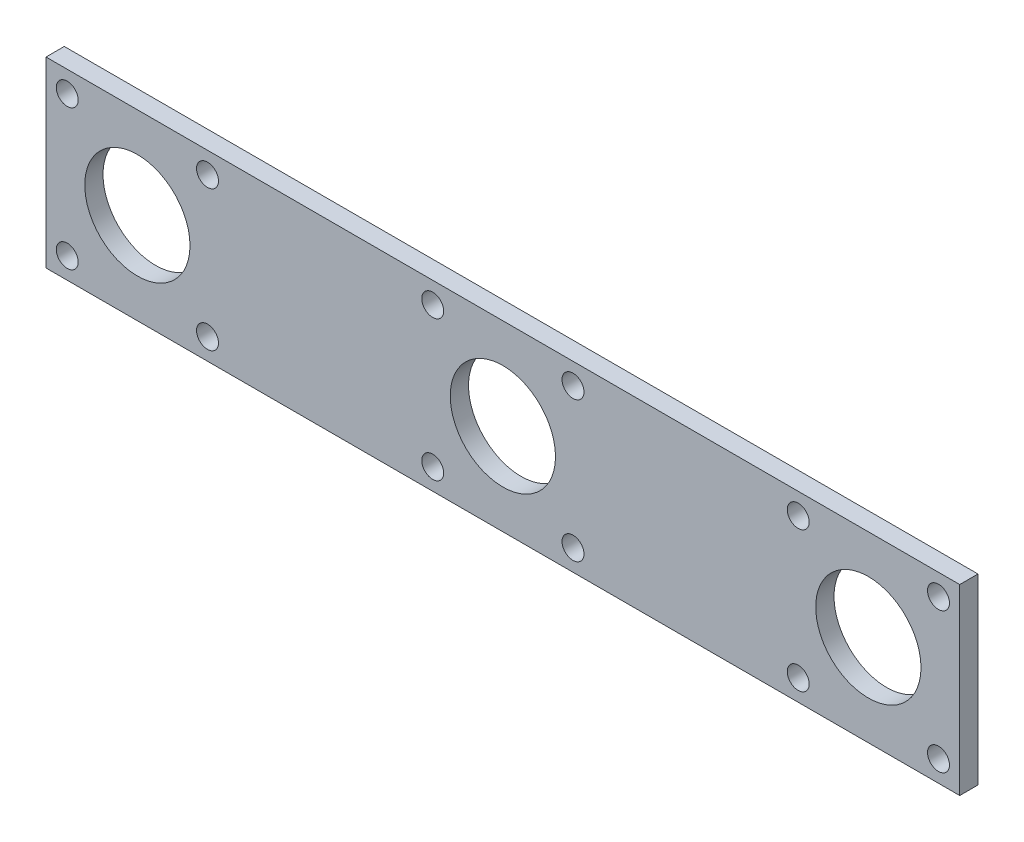
ISO-10303-21;
HEADER;
FILE_DESCRIPTION(('STEP AP214'),'2;1');
FILE_NAME('part.step','',(''),(''),'','','');
FILE_SCHEMA(('AUTOMOTIVE_DESIGN { 1 0 10303 214 1 1 1 1 }'));
ENDSEC;
DATA;
#1=APPLICATION_CONTEXT('core data for automotive mechanical design processes');
#2=APPLICATION_PROTOCOL_DEFINITION('international standard','automotive_design',2000,#1);
#3=PRODUCT_CONTEXT('',#1,'mechanical');
#4=PRODUCT('Part','Part','',(#3));
#5=PRODUCT_RELATED_PRODUCT_CATEGORY('part','',(#4));
#6=PRODUCT_DEFINITION_FORMATION('','',#4);
#7=PRODUCT_DEFINITION_CONTEXT('part definition',#1,'design');
#8=PRODUCT_DEFINITION('design','',#6,#7);
#9=PRODUCT_DEFINITION_SHAPE('','',#8);
#10=(LENGTH_UNIT() NAMED_UNIT(*) SI_UNIT(.MILLI.,.METRE.));
#11=(NAMED_UNIT(*) PLANE_ANGLE_UNIT() SI_UNIT($,.RADIAN.));
#12=(NAMED_UNIT(*) SI_UNIT($,.STERADIAN.) SOLID_ANGLE_UNIT());
#13=UNCERTAINTY_MEASURE_WITH_UNIT(LENGTH_MEASURE(1.E-05),#10,'distance_accuracy_value','');
#14=(GEOMETRIC_REPRESENTATION_CONTEXT(3) GLOBAL_UNCERTAINTY_ASSIGNED_CONTEXT((#13)) GLOBAL_UNIT_ASSIGNED_CONTEXT((#10,
#11,#12)) REPRESENTATION_CONTEXT('',''));
#15=CARTESIAN_POINT('',(0.,0.,0.));
#16=DIRECTION('',(0.,0.,1.));
#17=DIRECTION('',(1.,0.,0.));
#18=AXIS2_PLACEMENT_3D('',#15,#16,#17);
#19=CARTESIAN_POINT('',(0.,0.,2.54));
#20=DIRECTION('',(0.,0.,-1.));
#21=DIRECTION('',(-1.,0.,0.));
#22=AXIS2_PLACEMENT_3D('',#19,#20,#21);
#23=PLANE('',#22);
#24=DIRECTION('',(0.,1.,0.));
#25=VECTOR('',#24,1.);
#26=CARTESIAN_POINT('',(63.5,-12.7,2.54));
#27=LINE('',#26,#25);
#28=CARTESIAN_POINT('',(63.5,-12.7,2.54));
#29=VERTEX_POINT('',#28);
#30=CARTESIAN_POINT('',(63.5,12.7,2.54));
#31=VERTEX_POINT('',#30);
#32=EDGE_CURVE('E92',#29,#31,#27,.T.);
#33=ORIENTED_EDGE('',*,*,#32,.T.);
#34=DIRECTION('',(-1.,0.,0.));
#35=VECTOR('',#34,1.);
#36=CARTESIAN_POINT('',(-63.5,12.7,2.54));
#37=LINE('',#36,#35);
#38=CARTESIAN_POINT('',(-63.5,12.7,2.54));
#39=VERTEX_POINT('',#38);
#40=EDGE_CURVE('E87',#31,#39,#37,.T.);
#41=ORIENTED_EDGE('',*,*,#40,.T.);
#42=DIRECTION('',(0.,-1.,0.));
#43=VECTOR('',#42,1.);
#44=CARTESIAN_POINT('',(-63.5,-12.7,2.54));
#45=LINE('',#44,#43);
#46=CARTESIAN_POINT('',(-63.5,-12.7,2.54));
#47=VERTEX_POINT('',#46);
#48=EDGE_CURVE('E90',#39,#47,#45,.T.);
#49=ORIENTED_EDGE('',*,*,#48,.T.);
#50=DIRECTION('',(1.,0.,0.));
#51=VECTOR('',#50,1.);
#52=CARTESIAN_POINT('',(-63.5,-12.7,2.54));
#53=LINE('',#52,#51);
#54=EDGE_CURVE('E57',#47,#29,#53,.T.);
#55=ORIENTED_EDGE('',*,*,#54,.T.);
#56=EDGE_LOOP('',(#33,#41,#49,#55));
#57=FACE_BOUND('',#56,.T.);
#58=CARTESIAN_POINT('',(0.,0.,2.54));
#59=DIRECTION('',(0.,0.,1.));
#60=DIRECTION('',(1.,0.,0.));
#61=AXIS2_PLACEMENT_3D('',#58,#59,#60);
#62=CIRCLE('',#61,7.3152);
#63=CARTESIAN_POINT('',(7.3152,0.,2.54));
#64=VERTEX_POINT('',#63);
#65=EDGE_CURVE('E112',#64,#64,#62,.T.);
#66=ORIENTED_EDGE('',*,*,#65,.F.);
#67=EDGE_LOOP('',(#66));
#68=FACE_BOUND('',#67,.T.);
#69=CARTESIAN_POINT('',(9.74840085287846,9.74840085287846,2.54));
#70=DIRECTION('',(0.,0.,1.));
#71=DIRECTION('',(1.,0.,0.));
#72=AXIS2_PLACEMENT_3D('',#69,#70,#71);
#73=CIRCLE('',#72,1.524);
#74=CARTESIAN_POINT('',(11.2724008528785,9.74840085287846,2.54));
#75=VERTEX_POINT('',#74);
#76=EDGE_CURVE('E134',#75,#75,#73,.T.);
#77=ORIENTED_EDGE('',*,*,#76,.F.);
#78=EDGE_LOOP('',(#77));
#79=FACE_BOUND('',#78,.T.);
#80=CARTESIAN_POINT('',(-9.74840085287846,-9.74840085287847,2.54));
#81=DIRECTION('',(0.,0.,1.));
#82=DIRECTION('',(1.,0.,0.));
#83=AXIS2_PLACEMENT_3D('',#80,#81,#82);
#84=CIRCLE('',#83,1.524);
#85=CARTESIAN_POINT('',(-8.22440085287846,-9.74840085287847,2.54));
#86=VERTEX_POINT('',#85);
#87=EDGE_CURVE('E142',#86,#86,#84,.T.);
#88=ORIENTED_EDGE('',*,*,#87,.F.);
#89=EDGE_LOOP('',(#88));
#90=FACE_BOUND('',#89,.T.);
#91=CARTESIAN_POINT('',(9.74840085287846,-9.74840085287847,2.54));
#92=DIRECTION('',(0.,0.,1.));
#93=DIRECTION('',(1.,0.,0.));
#94=AXIS2_PLACEMENT_3D('',#91,#92,#93);
#95=CIRCLE('',#94,1.524);
#96=CARTESIAN_POINT('',(11.2724008528785,-9.74840085287847,2.54));
#97=VERTEX_POINT('',#96);
#98=EDGE_CURVE('E150',#97,#97,#95,.T.);
#99=ORIENTED_EDGE('',*,*,#98,.F.);
#100=EDGE_LOOP('',(#99));
#101=FACE_BOUND('',#100,.T.);
#102=CARTESIAN_POINT('',(-9.74840085287846,9.74840085287846,2.54));
#103=DIRECTION('',(0.,0.,1.));
#104=DIRECTION('',(1.,0.,0.));
#105=AXIS2_PLACEMENT_3D('',#102,#103,#104);
#106=CIRCLE('',#105,1.524);
#107=CARTESIAN_POINT('',(-8.22440085287846,9.74840085287846,2.54));
#108=VERTEX_POINT('',#107);
#109=EDGE_CURVE('E158',#108,#108,#106,.T.);
#110=ORIENTED_EDGE('',*,*,#109,.F.);
#111=EDGE_LOOP('',(#110));
#112=FACE_BOUND('',#111,.T.);
#113=CARTESIAN_POINT('',(50.8,0.,2.54));
#114=DIRECTION('',(0.,0.,1.));
#115=DIRECTION('',(1.,0.,0.));
#116=AXIS2_PLACEMENT_3D('',#113,#114,#115);
#117=CIRCLE('',#116,7.3152);
#118=CARTESIAN_POINT('',(58.1152,0.,2.54));
#119=VERTEX_POINT('',#118);
#120=EDGE_CURVE('E166',#119,#119,#117,.T.);
#121=ORIENTED_EDGE('',*,*,#120,.F.);
#122=EDGE_LOOP('',(#121));
#123=FACE_BOUND('',#122,.T.);
#124=CARTESIAN_POINT('',(60.5484008528785,9.74840085287846,2.54));
#125=DIRECTION('',(0.,0.,1.));
#126=DIRECTION('',(1.,0.,0.));
#127=AXIS2_PLACEMENT_3D('',#124,#125,#126);
#128=CIRCLE('',#127,1.524);
#129=CARTESIAN_POINT('',(62.0724008528785,9.74840085287846,2.54));
#130=VERTEX_POINT('',#129);
#131=EDGE_CURVE('E174',#130,#130,#128,.T.);
#132=ORIENTED_EDGE('',*,*,#131,.F.);
#133=EDGE_LOOP('',(#132));
#134=FACE_BOUND('',#133,.T.);
#135=CARTESIAN_POINT('',(41.0515991471215,-9.74840085287847,2.54));
#136=DIRECTION('',(0.,0.,1.));
#137=DIRECTION('',(1.,0.,0.));
#138=AXIS2_PLACEMENT_3D('',#135,#136,#137);
#139=CIRCLE('',#138,1.52400000000001);
#140=CARTESIAN_POINT('',(42.5755991471215,-9.74840085287847,2.54));
#141=VERTEX_POINT('',#140);
#142=EDGE_CURVE('E182',#141,#141,#139,.T.);
#143=ORIENTED_EDGE('',*,*,#142,.F.);
#144=EDGE_LOOP('',(#143));
#145=FACE_BOUND('',#144,.T.);
#146=CARTESIAN_POINT('',(60.5484008528785,-9.74840085287847,2.54));
#147=DIRECTION('',(0.,0.,1.));
#148=DIRECTION('',(1.,0.,0.));
#149=AXIS2_PLACEMENT_3D('',#146,#147,#148);
#150=CIRCLE('',#149,1.524);
#151=CARTESIAN_POINT('',(62.0724008528785,-9.74840085287847,2.54));
#152=VERTEX_POINT('',#151);
#153=EDGE_CURVE('E190',#152,#152,#150,.T.);
#154=ORIENTED_EDGE('',*,*,#153,.F.);
#155=EDGE_LOOP('',(#154));
#156=FACE_BOUND('',#155,.T.);
#157=CARTESIAN_POINT('',(41.0515991471215,9.74840085287846,2.54));
#158=DIRECTION('',(0.,0.,1.));
#159=DIRECTION('',(1.,0.,0.));
#160=AXIS2_PLACEMENT_3D('',#157,#158,#159);
#161=CIRCLE('',#160,1.52400000000001);
#162=CARTESIAN_POINT('',(42.5755991471215,9.74840085287846,2.54));
#163=VERTEX_POINT('',#162);
#164=EDGE_CURVE('E198',#163,#163,#161,.T.);
#165=ORIENTED_EDGE('',*,*,#164,.F.);
#166=EDGE_LOOP('',(#165));
#167=FACE_BOUND('',#166,.T.);
#168=CARTESIAN_POINT('',(-50.8,0.,2.54));
#169=DIRECTION('',(0.,0.,1.));
#170=DIRECTION('',(1.,0.,0.));
#171=AXIS2_PLACEMENT_3D('',#168,#169,#170);
#172=CIRCLE('',#171,7.3152);
#173=CARTESIAN_POINT('',(-43.4848,0.,2.54));
#174=VERTEX_POINT('',#173);
#175=EDGE_CURVE('E206',#174,#174,#172,.T.);
#176=ORIENTED_EDGE('',*,*,#175,.F.);
#177=EDGE_LOOP('',(#176));
#178=FACE_BOUND('',#177,.T.);
#179=CARTESIAN_POINT('',(-41.0515991471215,9.74840085287846,2.54));
#180=DIRECTION('',(0.,0.,1.));
#181=DIRECTION('',(1.,0.,0.));
#182=AXIS2_PLACEMENT_3D('',#179,#180,#181);
#183=CIRCLE('',#182,1.524);
#184=CARTESIAN_POINT('',(-39.5275991471215,9.74840085287846,2.54));
#185=VERTEX_POINT('',#184);
#186=EDGE_CURVE('E214',#185,#185,#183,.T.);
#187=ORIENTED_EDGE('',*,*,#186,.F.);
#188=EDGE_LOOP('',(#187));
#189=FACE_BOUND('',#188,.T.);
#190=CARTESIAN_POINT('',(-60.5484008528785,-9.74840085287847,2.54));
#191=DIRECTION('',(0.,0.,1.));
#192=DIRECTION('',(1.,0.,0.));
#193=AXIS2_PLACEMENT_3D('',#190,#191,#192);
#194=CIRCLE('',#193,1.52400000000001);
#195=CARTESIAN_POINT('',(-59.0244008528785,-9.74840085287847,2.54));
#196=VERTEX_POINT('',#195);
#197=EDGE_CURVE('E222',#196,#196,#194,.T.);
#198=ORIENTED_EDGE('',*,*,#197,.F.);
#199=EDGE_LOOP('',(#198));
#200=FACE_BOUND('',#199,.T.);
#201=CARTESIAN_POINT('',(-41.0515991471215,-9.74840085287847,2.54));
#202=DIRECTION('',(0.,0.,1.));
#203=DIRECTION('',(1.,0.,0.));
#204=AXIS2_PLACEMENT_3D('',#201,#202,#203);
#205=CIRCLE('',#204,1.524);
#206=CARTESIAN_POINT('',(-39.5275991471215,-9.74840085287847,2.54));
#207=VERTEX_POINT('',#206);
#208=EDGE_CURVE('E230',#207,#207,#205,.T.);
#209=ORIENTED_EDGE('',*,*,#208,.F.);
#210=EDGE_LOOP('',(#209));
#211=FACE_BOUND('',#210,.T.);
#212=CARTESIAN_POINT('',(-60.5484008528785,9.74840085287846,2.54));
#213=DIRECTION('',(0.,0.,1.));
#214=DIRECTION('',(1.,0.,0.));
#215=AXIS2_PLACEMENT_3D('',#212,#213,#214);
#216=CIRCLE('',#215,1.524);
#217=CARTESIAN_POINT('',(-59.0244008528785,9.74840085287846,2.54));
#218=VERTEX_POINT('',#217);
#219=EDGE_CURVE('E238',#218,#218,#216,.T.);
#220=ORIENTED_EDGE('',*,*,#219,.F.);
#221=EDGE_LOOP('',(#220));
#222=FACE_BOUND('',#221,.T.);
#223=ADVANCED_FACE('F39',(#57,#68,#79,#90,#101,#112,#123,#134,#145,#156,#167,#178,#189,#200,
#211,#222),#23,.F.);
#224=CARTESIAN_POINT('',(0.,0.,0.));
#225=DIRECTION('',(0.,0.,-1.));
#226=DIRECTION('',(-1.,0.,0.));
#227=AXIS2_PLACEMENT_3D('',#224,#225,#226);
#228=PLANE('',#227);
#229=CARTESIAN_POINT('',(-41.0515991471215,-9.74840085287847,0.));
#230=DIRECTION('',(0.,0.,1.));
#231=DIRECTION('',(1.,0.,0.));
#232=AXIS2_PLACEMENT_3D('',#229,#230,#231);
#233=CIRCLE('',#232,1.524);
#234=CARTESIAN_POINT('',(-39.5275991471215,-9.74840085287847,0.));
#235=VERTEX_POINT('',#234);
#236=EDGE_CURVE('E234',#235,#235,#233,.T.);
#237=ORIENTED_EDGE('',*,*,#236,.T.);
#238=EDGE_LOOP('',(#237));
#239=FACE_BOUND('',#238,.T.);
#240=CARTESIAN_POINT('',(-41.0515991471215,9.74840085287846,0.));
#241=DIRECTION('',(0.,0.,1.));
#242=DIRECTION('',(1.,0.,0.));
#243=AXIS2_PLACEMENT_3D('',#240,#241,#242);
#244=CIRCLE('',#243,1.524);
#245=CARTESIAN_POINT('',(-39.5275991471215,9.74840085287846,0.));
#246=VERTEX_POINT('',#245);
#247=EDGE_CURVE('E218',#246,#246,#244,.T.);
#248=ORIENTED_EDGE('',*,*,#247,.T.);
#249=EDGE_LOOP('',(#248));
#250=FACE_BOUND('',#249,.T.);
#251=CARTESIAN_POINT('',(41.0515991471215,9.74840085287846,0.));
#252=DIRECTION('',(0.,0.,1.));
#253=DIRECTION('',(1.,0.,0.));
#254=AXIS2_PLACEMENT_3D('',#251,#252,#253);
#255=CIRCLE('',#254,1.52400000000001);
#256=CARTESIAN_POINT('',(42.5755991471215,9.74840085287846,0.));
#257=VERTEX_POINT('',#256);
#258=EDGE_CURVE('E202',#257,#257,#255,.T.);
#259=ORIENTED_EDGE('',*,*,#258,.T.);
#260=EDGE_LOOP('',(#259));
#261=FACE_BOUND('',#260,.T.);
#262=CARTESIAN_POINT('',(41.0515991471215,-9.74840085287847,0.));
#263=DIRECTION('',(0.,0.,1.));
#264=DIRECTION('',(1.,0.,0.));
#265=AXIS2_PLACEMENT_3D('',#262,#263,#264);
#266=CIRCLE('',#265,1.52400000000001);
#267=CARTESIAN_POINT('',(42.5755991471215,-9.74840085287847,0.));
#268=VERTEX_POINT('',#267);
#269=EDGE_CURVE('E186',#268,#268,#266,.T.);
#270=ORIENTED_EDGE('',*,*,#269,.T.);
#271=EDGE_LOOP('',(#270));
#272=FACE_BOUND('',#271,.T.);
#273=CARTESIAN_POINT('',(50.8,0.,0.));
#274=DIRECTION('',(0.,0.,1.));
#275=DIRECTION('',(1.,0.,0.));
#276=AXIS2_PLACEMENT_3D('',#273,#274,#275);
#277=CIRCLE('',#276,7.3152);
#278=CARTESIAN_POINT('',(58.1152,0.,0.));
#279=VERTEX_POINT('',#278);
#280=EDGE_CURVE('E170',#279,#279,#277,.T.);
#281=ORIENTED_EDGE('',*,*,#280,.T.);
#282=EDGE_LOOP('',(#281));
#283=FACE_BOUND('',#282,.T.);
#284=CARTESIAN_POINT('',(9.74840085287846,-9.74840085287847,0.));
#285=DIRECTION('',(0.,0.,1.));
#286=DIRECTION('',(1.,0.,0.));
#287=AXIS2_PLACEMENT_3D('',#284,#285,#286);
#288=CIRCLE('',#287,1.524);
#289=CARTESIAN_POINT('',(11.2724008528785,-9.74840085287847,0.));
#290=VERTEX_POINT('',#289);
#291=EDGE_CURVE('E154',#290,#290,#288,.T.);
#292=ORIENTED_EDGE('',*,*,#291,.T.);
#293=EDGE_LOOP('',(#292));
#294=FACE_BOUND('',#293,.T.);
#295=CARTESIAN_POINT('',(9.74840085287846,9.74840085287846,0.));
#296=DIRECTION('',(0.,0.,1.));
#297=DIRECTION('',(1.,0.,0.));
#298=AXIS2_PLACEMENT_3D('',#295,#296,#297);
#299=CIRCLE('',#298,1.524);
#300=CARTESIAN_POINT('',(11.2724008528785,9.74840085287846,0.));
#301=VERTEX_POINT('',#300);
#302=EDGE_CURVE('E138',#301,#301,#299,.T.);
#303=ORIENTED_EDGE('',*,*,#302,.T.);
#304=EDGE_LOOP('',(#303));
#305=FACE_BOUND('',#304,.T.);
#306=DIRECTION('',(0.,1.,0.));
#307=VECTOR('',#306,1.);
#308=CARTESIAN_POINT('',(63.5,-12.7,0.));
#309=LINE('',#308,#307);
#310=CARTESIAN_POINT('',(63.5,-12.7,0.));
#311=VERTEX_POINT('',#310);
#312=CARTESIAN_POINT('',(63.5,12.7,0.));
#313=VERTEX_POINT('',#312);
#314=EDGE_CURVE('E108',#311,#313,#309,.T.);
#315=ORIENTED_EDGE('',*,*,#314,.F.);
#316=DIRECTION('',(1.,0.,0.));
#317=VECTOR('',#316,1.);
#318=CARTESIAN_POINT('',(-63.5,-12.7,0.));
#319=LINE('',#318,#317);
#320=CARTESIAN_POINT('',(-63.5,-12.7,0.));
#321=VERTEX_POINT('',#320);
#322=EDGE_CURVE('E80',#321,#311,#319,.T.);
#323=ORIENTED_EDGE('',*,*,#322,.F.);
#324=DIRECTION('',(0.,-1.,0.));
#325=VECTOR('',#324,1.);
#326=CARTESIAN_POINT('',(-63.5,-12.7,0.));
#327=LINE('',#326,#325);
#328=CARTESIAN_POINT('',(-63.5,12.7,0.));
#329=VERTEX_POINT('',#328);
#330=EDGE_CURVE('E74',#329,#321,#327,.T.);
#331=ORIENTED_EDGE('',*,*,#330,.F.);
#332=DIRECTION('',(-1.,0.,0.));
#333=VECTOR('',#332,1.);
#334=CARTESIAN_POINT('',(-63.5,12.7,0.));
#335=LINE('',#334,#333);
#336=EDGE_CURVE('E97',#313,#329,#335,.T.);
#337=ORIENTED_EDGE('',*,*,#336,.F.);
#338=EDGE_LOOP('',(#315,#323,#331,#337));
#339=FACE_BOUND('',#338,.T.);
#340=CARTESIAN_POINT('',(0.,0.,0.));
#341=DIRECTION('',(0.,0.,1.));
#342=DIRECTION('',(1.,0.,0.));
#343=AXIS2_PLACEMENT_3D('',#340,#341,#342);
#344=CIRCLE('',#343,7.3152);
#345=CARTESIAN_POINT('',(7.3152,0.,0.));
#346=VERTEX_POINT('',#345);
#347=EDGE_CURVE('E130',#346,#346,#344,.T.);
#348=ORIENTED_EDGE('',*,*,#347,.T.);
#349=EDGE_LOOP('',(#348));
#350=FACE_BOUND('',#349,.T.);
#351=CARTESIAN_POINT('',(-9.74840085287846,-9.74840085287847,0.));
#352=DIRECTION('',(0.,0.,1.));
#353=DIRECTION('',(1.,0.,0.));
#354=AXIS2_PLACEMENT_3D('',#351,#352,#353);
#355=CIRCLE('',#354,1.524);
#356=CARTESIAN_POINT('',(-8.22440085287846,-9.74840085287847,0.));
#357=VERTEX_POINT('',#356);
#358=EDGE_CURVE('E146',#357,#357,#355,.T.);
#359=ORIENTED_EDGE('',*,*,#358,.T.);
#360=EDGE_LOOP('',(#359));
#361=FACE_BOUND('',#360,.T.);
#362=CARTESIAN_POINT('',(-9.74840085287846,9.74840085287846,0.));
#363=DIRECTION('',(0.,0.,1.));
#364=DIRECTION('',(1.,0.,0.));
#365=AXIS2_PLACEMENT_3D('',#362,#363,#364);
#366=CIRCLE('',#365,1.524);
#367=CARTESIAN_POINT('',(-8.22440085287846,9.74840085287846,0.));
#368=VERTEX_POINT('',#367);
#369=EDGE_CURVE('E162',#368,#368,#366,.T.);
#370=ORIENTED_EDGE('',*,*,#369,.T.);
#371=EDGE_LOOP('',(#370));
#372=FACE_BOUND('',#371,.T.);
#373=CARTESIAN_POINT('',(60.5484008528785,9.74840085287846,0.));
#374=DIRECTION('',(0.,0.,1.));
#375=DIRECTION('',(1.,0.,0.));
#376=AXIS2_PLACEMENT_3D('',#373,#374,#375);
#377=CIRCLE('',#376,1.524);
#378=CARTESIAN_POINT('',(62.0724008528785,9.74840085287846,0.));
#379=VERTEX_POINT('',#378);
#380=EDGE_CURVE('E178',#379,#379,#377,.T.);
#381=ORIENTED_EDGE('',*,*,#380,.T.);
#382=EDGE_LOOP('',(#381));
#383=FACE_BOUND('',#382,.T.);
#384=CARTESIAN_POINT('',(60.5484008528785,-9.74840085287847,0.));
#385=DIRECTION('',(0.,0.,1.));
#386=DIRECTION('',(1.,0.,0.));
#387=AXIS2_PLACEMENT_3D('',#384,#385,#386);
#388=CIRCLE('',#387,1.524);
#389=CARTESIAN_POINT('',(62.0724008528785,-9.74840085287847,0.));
#390=VERTEX_POINT('',#389);
#391=EDGE_CURVE('E194',#390,#390,#388,.T.);
#392=ORIENTED_EDGE('',*,*,#391,.T.);
#393=EDGE_LOOP('',(#392));
#394=FACE_BOUND('',#393,.T.);
#395=CARTESIAN_POINT('',(-50.8,0.,0.));
#396=DIRECTION('',(0.,0.,1.));
#397=DIRECTION('',(1.,0.,0.));
#398=AXIS2_PLACEMENT_3D('',#395,#396,#397);
#399=CIRCLE('',#398,7.3152);
#400=CARTESIAN_POINT('',(-43.4848,0.,0.));
#401=VERTEX_POINT('',#400);
#402=EDGE_CURVE('E210',#401,#401,#399,.T.);
#403=ORIENTED_EDGE('',*,*,#402,.T.);
#404=EDGE_LOOP('',(#403));
#405=FACE_BOUND('',#404,.T.);
#406=CARTESIAN_POINT('',(-60.5484008528785,-9.74840085287847,0.));
#407=DIRECTION('',(0.,0.,1.));
#408=DIRECTION('',(1.,0.,0.));
#409=AXIS2_PLACEMENT_3D('',#406,#407,#408);
#410=CIRCLE('',#409,1.52400000000001);
#411=CARTESIAN_POINT('',(-59.0244008528785,-9.74840085287847,0.));
#412=VERTEX_POINT('',#411);
#413=EDGE_CURVE('E226',#412,#412,#410,.T.);
#414=ORIENTED_EDGE('',*,*,#413,.T.);
#415=EDGE_LOOP('',(#414));
#416=FACE_BOUND('',#415,.T.);
#417=CARTESIAN_POINT('',(-60.5484008528785,9.74840085287846,0.));
#418=DIRECTION('',(0.,0.,1.));
#419=DIRECTION('',(1.,0.,0.));
#420=AXIS2_PLACEMENT_3D('',#417,#418,#419);
#421=CIRCLE('',#420,1.524);
#422=CARTESIAN_POINT('',(-59.0244008528785,9.74840085287846,0.));
#423=VERTEX_POINT('',#422);
#424=EDGE_CURVE('E242',#423,#423,#421,.T.);
#425=ORIENTED_EDGE('',*,*,#424,.T.);
#426=EDGE_LOOP('',(#425));
#427=FACE_BOUND('',#426,.T.);
#428=ADVANCED_FACE('F125',(#239,#250,#261,#272,#283,#294,#305,#339,#350,#361,#372,#383,#394,
#405,#416,#427),#228,.T.);
#429=CARTESIAN_POINT('',(63.5,-12.7,2.54));
#430=DIRECTION('',(-1.,0.,0.));
#431=DIRECTION('',(0.,0.,1.));
#432=AXIS2_PLACEMENT_3D('',#429,#430,#431);
#433=PLANE('',#432);
#434=ORIENTED_EDGE('',*,*,#314,.T.);
#435=DIRECTION('',(0.,0.,-1.));
#436=VECTOR('',#435,1.);
#437=CARTESIAN_POINT('',(63.5,12.7,2.54));
#438=LINE('',#437,#436);
#439=EDGE_CURVE('E11',#31,#313,#438,.T.);
#440=ORIENTED_EDGE('',*,*,#439,.F.);
#441=ORIENTED_EDGE('',*,*,#32,.F.);
#442=DIRECTION('',(0.,0.,-1.));
#443=VECTOR('',#442,1.);
#444=CARTESIAN_POINT('',(63.5,-12.7,2.54));
#445=LINE('',#444,#443);
#446=EDGE_CURVE('E104',#29,#311,#445,.T.);
#447=ORIENTED_EDGE('',*,*,#446,.T.);
#448=EDGE_LOOP('',(#434,#440,#441,#447));
#449=FACE_BOUND('',#448,.T.);
#450=ADVANCED_FACE('F41',(#449),#433,.F.);
#451=CARTESIAN_POINT('',(-63.5,12.7,2.54));
#452=DIRECTION('',(0.,-1.,0.));
#453=DIRECTION('',(0.,0.,-1.));
#454=AXIS2_PLACEMENT_3D('',#451,#452,#453);
#455=PLANE('',#454);
#456=ORIENTED_EDGE('',*,*,#336,.T.);
#457=DIRECTION('',(0.,0.,-1.));
#458=VECTOR('',#457,1.);
#459=CARTESIAN_POINT('',(-63.5,12.7,2.54));
#460=LINE('',#459,#458);
#461=EDGE_CURVE('E49',#39,#329,#460,.T.);
#462=ORIENTED_EDGE('',*,*,#461,.F.);
#463=ORIENTED_EDGE('',*,*,#40,.F.);
#464=ORIENTED_EDGE('',*,*,#439,.T.);
#465=EDGE_LOOP('',(#456,#462,#463,#464));
#466=FACE_BOUND('',#465,.T.);
#467=ADVANCED_FACE('F96',(#466),#455,.F.);
#468=CARTESIAN_POINT('',(-63.5,-12.7,2.54));
#469=DIRECTION('',(1.,0.,0.));
#470=DIRECTION('',(0.,0.,-1.));
#471=AXIS2_PLACEMENT_3D('',#468,#469,#470);
#472=PLANE('',#471);
#473=ORIENTED_EDGE('',*,*,#330,.T.);
#474=DIRECTION('',(0.,0.,-1.));
#475=VECTOR('',#474,1.);
#476=CARTESIAN_POINT('',(-63.5,-12.7,2.54));
#477=LINE('',#476,#475);
#478=EDGE_CURVE('E99',#47,#321,#477,.T.);
#479=ORIENTED_EDGE('',*,*,#478,.F.);
#480=ORIENTED_EDGE('',*,*,#48,.F.);
#481=ORIENTED_EDGE('',*,*,#461,.T.);
#482=EDGE_LOOP('',(#473,#479,#480,#481));
#483=FACE_BOUND('',#482,.T.);
#484=ADVANCED_FACE('F100',(#483),#472,.F.);
#485=CARTESIAN_POINT('',(-63.5,-12.7,2.54));
#486=DIRECTION('',(0.,1.,0.));
#487=DIRECTION('',(0.,0.,1.));
#488=AXIS2_PLACEMENT_3D('',#485,#486,#487);
#489=PLANE('',#488);
#490=ORIENTED_EDGE('',*,*,#322,.T.);
#491=ORIENTED_EDGE('',*,*,#446,.F.);
#492=ORIENTED_EDGE('',*,*,#54,.F.);
#493=ORIENTED_EDGE('',*,*,#478,.T.);
#494=EDGE_LOOP('',(#490,#491,#492,#493));
#495=FACE_BOUND('',#494,.T.);
#496=ADVANCED_FACE('F122',(#495),#489,.F.);
#497=CARTESIAN_POINT('',(0.,0.,2.54));
#498=DIRECTION('',(0.,0.,-1.));
#499=DIRECTION('',(-1.,0.,0.));
#500=AXIS2_PLACEMENT_3D('',#497,#498,#499);
#501=CYLINDRICAL_SURFACE('',#500,7.3152);
#502=ORIENTED_EDGE('',*,*,#65,.T.);
#503=EDGE_LOOP('',(#502));
#504=FACE_BOUND('',#503,.T.);
#505=ORIENTED_EDGE('',*,*,#347,.F.);
#506=EDGE_LOOP('',(#505));
#507=FACE_BOUND('',#506,.T.);
#508=ADVANCED_FACE('F261',(#504,#507),#501,.F.);
#509=CARTESIAN_POINT('',(9.74840085287846,9.74840085287846,2.54));
#510=DIRECTION('',(0.,0.,-1.));
#511=DIRECTION('',(-1.,0.,0.));
#512=AXIS2_PLACEMENT_3D('',#509,#510,#511);
#513=CYLINDRICAL_SURFACE('',#512,1.524);
#514=ORIENTED_EDGE('',*,*,#76,.T.);
#515=EDGE_LOOP('',(#514));
#516=FACE_BOUND('',#515,.T.);
#517=ORIENTED_EDGE('',*,*,#302,.F.);
#518=EDGE_LOOP('',(#517));
#519=FACE_BOUND('',#518,.T.);
#520=ADVANCED_FACE('F307',(#516,#519),#513,.F.);
#521=CARTESIAN_POINT('',(-9.74840085287846,-9.74840085287847,2.54));
#522=DIRECTION('',(0.,0.,-1.));
#523=DIRECTION('',(-1.,0.,0.));
#524=AXIS2_PLACEMENT_3D('',#521,#522,#523);
#525=CYLINDRICAL_SURFACE('',#524,1.524);
#526=ORIENTED_EDGE('',*,*,#87,.T.);
#527=EDGE_LOOP('',(#526));
#528=FACE_BOUND('',#527,.T.);
#529=ORIENTED_EDGE('',*,*,#358,.F.);
#530=EDGE_LOOP('',(#529));
#531=FACE_BOUND('',#530,.T.);
#532=ADVANCED_FACE('F315',(#528,#531),#525,.F.);
#533=CARTESIAN_POINT('',(9.74840085287846,-9.74840085287847,2.54));
#534=DIRECTION('',(0.,0.,-1.));
#535=DIRECTION('',(-1.,0.,0.));
#536=AXIS2_PLACEMENT_3D('',#533,#534,#535);
#537=CYLINDRICAL_SURFACE('',#536,1.524);
#538=ORIENTED_EDGE('',*,*,#98,.T.);
#539=EDGE_LOOP('',(#538));
#540=FACE_BOUND('',#539,.T.);
#541=ORIENTED_EDGE('',*,*,#291,.F.);
#542=EDGE_LOOP('',(#541));
#543=FACE_BOUND('',#542,.T.);
#544=ADVANCED_FACE('F323',(#540,#543),#537,.F.);
#545=CARTESIAN_POINT('',(-9.74840085287846,9.74840085287846,2.54));
#546=DIRECTION('',(0.,0.,-1.));
#547=DIRECTION('',(-1.,0.,0.));
#548=AXIS2_PLACEMENT_3D('',#545,#546,#547);
#549=CYLINDRICAL_SURFACE('',#548,1.524);
#550=ORIENTED_EDGE('',*,*,#109,.T.);
#551=EDGE_LOOP('',(#550));
#552=FACE_BOUND('',#551,.T.);
#553=ORIENTED_EDGE('',*,*,#369,.F.);
#554=EDGE_LOOP('',(#553));
#555=FACE_BOUND('',#554,.T.);
#556=ADVANCED_FACE('F332',(#552,#555),#549,.F.);
#557=CARTESIAN_POINT('',(50.8,0.,2.54));
#558=DIRECTION('',(0.,0.,-1.));
#559=DIRECTION('',(-1.,0.,0.));
#560=AXIS2_PLACEMENT_3D('',#557,#558,#559);
#561=CYLINDRICAL_SURFACE('',#560,7.3152);
#562=ORIENTED_EDGE('',*,*,#120,.T.);
#563=EDGE_LOOP('',(#562));
#564=FACE_BOUND('',#563,.T.);
#565=ORIENTED_EDGE('',*,*,#280,.F.);
#566=EDGE_LOOP('',(#565));
#567=FACE_BOUND('',#566,.T.);
#568=ADVANCED_FACE('F341',(#564,#567),#561,.F.);
#569=CARTESIAN_POINT('',(60.5484008528785,9.74840085287846,2.54));
#570=DIRECTION('',(0.,0.,-1.));
#571=DIRECTION('',(-1.,0.,0.));
#572=AXIS2_PLACEMENT_3D('',#569,#570,#571);
#573=CYLINDRICAL_SURFACE('',#572,1.524);
#574=ORIENTED_EDGE('',*,*,#131,.T.);
#575=EDGE_LOOP('',(#574));
#576=FACE_BOUND('',#575,.T.);
#577=ORIENTED_EDGE('',*,*,#380,.F.);
#578=EDGE_LOOP('',(#577));
#579=FACE_BOUND('',#578,.T.);
#580=ADVANCED_FACE('F350',(#576,#579),#573,.F.);
#581=CARTESIAN_POINT('',(41.0515991471215,-9.74840085287847,2.54));
#582=DIRECTION('',(0.,0.,-1.));
#583=DIRECTION('',(-1.,0.,0.));
#584=AXIS2_PLACEMENT_3D('',#581,#582,#583);
#585=CYLINDRICAL_SURFACE('',#584,1.52400000000001);
#586=ORIENTED_EDGE('',*,*,#142,.T.);
#587=EDGE_LOOP('',(#586));
#588=FACE_BOUND('',#587,.T.);
#589=ORIENTED_EDGE('',*,*,#269,.F.);
#590=EDGE_LOOP('',(#589));
#591=FACE_BOUND('',#590,.T.);
#592=ADVANCED_FACE('F359',(#588,#591),#585,.F.);
#593=CARTESIAN_POINT('',(60.5484008528785,-9.74840085287847,2.54));
#594=DIRECTION('',(0.,0.,-1.));
#595=DIRECTION('',(-1.,0.,0.));
#596=AXIS2_PLACEMENT_3D('',#593,#594,#595);
#597=CYLINDRICAL_SURFACE('',#596,1.524);
#598=ORIENTED_EDGE('',*,*,#153,.T.);
#599=EDGE_LOOP('',(#598));
#600=FACE_BOUND('',#599,.T.);
#601=ORIENTED_EDGE('',*,*,#391,.F.);
#602=EDGE_LOOP('',(#601));
#603=FACE_BOUND('',#602,.T.);
#604=ADVANCED_FACE('F368',(#600,#603),#597,.F.);
#605=CARTESIAN_POINT('',(41.0515991471215,9.74840085287846,2.54));
#606=DIRECTION('',(0.,0.,-1.));
#607=DIRECTION('',(-1.,0.,0.));
#608=AXIS2_PLACEMENT_3D('',#605,#606,#607);
#609=CYLINDRICAL_SURFACE('',#608,1.52400000000001);
#610=ORIENTED_EDGE('',*,*,#164,.T.);
#611=EDGE_LOOP('',(#610));
#612=FACE_BOUND('',#611,.T.);
#613=ORIENTED_EDGE('',*,*,#258,.F.);
#614=EDGE_LOOP('',(#613));
#615=FACE_BOUND('',#614,.T.);
#616=ADVANCED_FACE('F377',(#612,#615),#609,.F.);
#617=CARTESIAN_POINT('',(-50.8,0.,2.54));
#618=DIRECTION('',(0.,0.,-1.));
#619=DIRECTION('',(-1.,0.,0.));
#620=AXIS2_PLACEMENT_3D('',#617,#618,#619);
#621=CYLINDRICAL_SURFACE('',#620,7.3152);
#622=ORIENTED_EDGE('',*,*,#175,.T.);
#623=EDGE_LOOP('',(#622));
#624=FACE_BOUND('',#623,.T.);
#625=ORIENTED_EDGE('',*,*,#402,.F.);
#626=EDGE_LOOP('',(#625));
#627=FACE_BOUND('',#626,.T.);
#628=ADVANCED_FACE('F386',(#624,#627),#621,.F.);
#629=CARTESIAN_POINT('',(-41.0515991471215,9.74840085287846,2.54));
#630=DIRECTION('',(0.,0.,-1.));
#631=DIRECTION('',(-1.,0.,0.));
#632=AXIS2_PLACEMENT_3D('',#629,#630,#631);
#633=CYLINDRICAL_SURFACE('',#632,1.524);
#634=ORIENTED_EDGE('',*,*,#186,.T.);
#635=EDGE_LOOP('',(#634));
#636=FACE_BOUND('',#635,.T.);
#637=ORIENTED_EDGE('',*,*,#247,.F.);
#638=EDGE_LOOP('',(#637));
#639=FACE_BOUND('',#638,.T.);
#640=ADVANCED_FACE('F395',(#636,#639),#633,.F.);
#641=CARTESIAN_POINT('',(-60.5484008528785,-9.74840085287847,2.54));
#642=DIRECTION('',(0.,0.,-1.));
#643=DIRECTION('',(-1.,0.,0.));
#644=AXIS2_PLACEMENT_3D('',#641,#642,#643);
#645=CYLINDRICAL_SURFACE('',#644,1.52400000000001);
#646=ORIENTED_EDGE('',*,*,#197,.T.);
#647=EDGE_LOOP('',(#646));
#648=FACE_BOUND('',#647,.T.);
#649=ORIENTED_EDGE('',*,*,#413,.F.);
#650=EDGE_LOOP('',(#649));
#651=FACE_BOUND('',#650,.T.);
#652=ADVANCED_FACE('F404',(#648,#651),#645,.F.);
#653=CARTESIAN_POINT('',(-41.0515991471215,-9.74840085287847,2.54));
#654=DIRECTION('',(0.,0.,-1.));
#655=DIRECTION('',(-1.,0.,0.));
#656=AXIS2_PLACEMENT_3D('',#653,#654,#655);
#657=CYLINDRICAL_SURFACE('',#656,1.524);
#658=ORIENTED_EDGE('',*,*,#208,.T.);
#659=EDGE_LOOP('',(#658));
#660=FACE_BOUND('',#659,.T.);
#661=ORIENTED_EDGE('',*,*,#236,.F.);
#662=EDGE_LOOP('',(#661));
#663=FACE_BOUND('',#662,.T.);
#664=ADVANCED_FACE('F413',(#660,#663),#657,.F.);
#665=CARTESIAN_POINT('',(-60.5484008528785,9.74840085287846,2.54));
#666=DIRECTION('',(0.,0.,-1.));
#667=DIRECTION('',(-1.,0.,0.));
#668=AXIS2_PLACEMENT_3D('',#665,#666,#667);
#669=CYLINDRICAL_SURFACE('',#668,1.524);
#670=ORIENTED_EDGE('',*,*,#219,.T.);
#671=EDGE_LOOP('',(#670));
#672=FACE_BOUND('',#671,.T.);
#673=ORIENTED_EDGE('',*,*,#424,.F.);
#674=EDGE_LOOP('',(#673));
#675=FACE_BOUND('',#674,.T.);
#676=ADVANCED_FACE('F250',(#672,#675),#669,.F.);
#677=CLOSED_SHELL('',(#223,#428,#450,#467,#484,#496,#508,#520,#532,#544,#556,#568,#580,#592,
#604,#616,#628,#640,#652,#664,#676));
#678=MANIFOLD_SOLID_BREP('B2',#677);
#679=ADVANCED_BREP_SHAPE_REPRESENTATION('',(#18,#678),#14);
#680=SHAPE_DEFINITION_REPRESENTATION(#9,#679);
ENDSEC;
END-ISO-10303-21;
